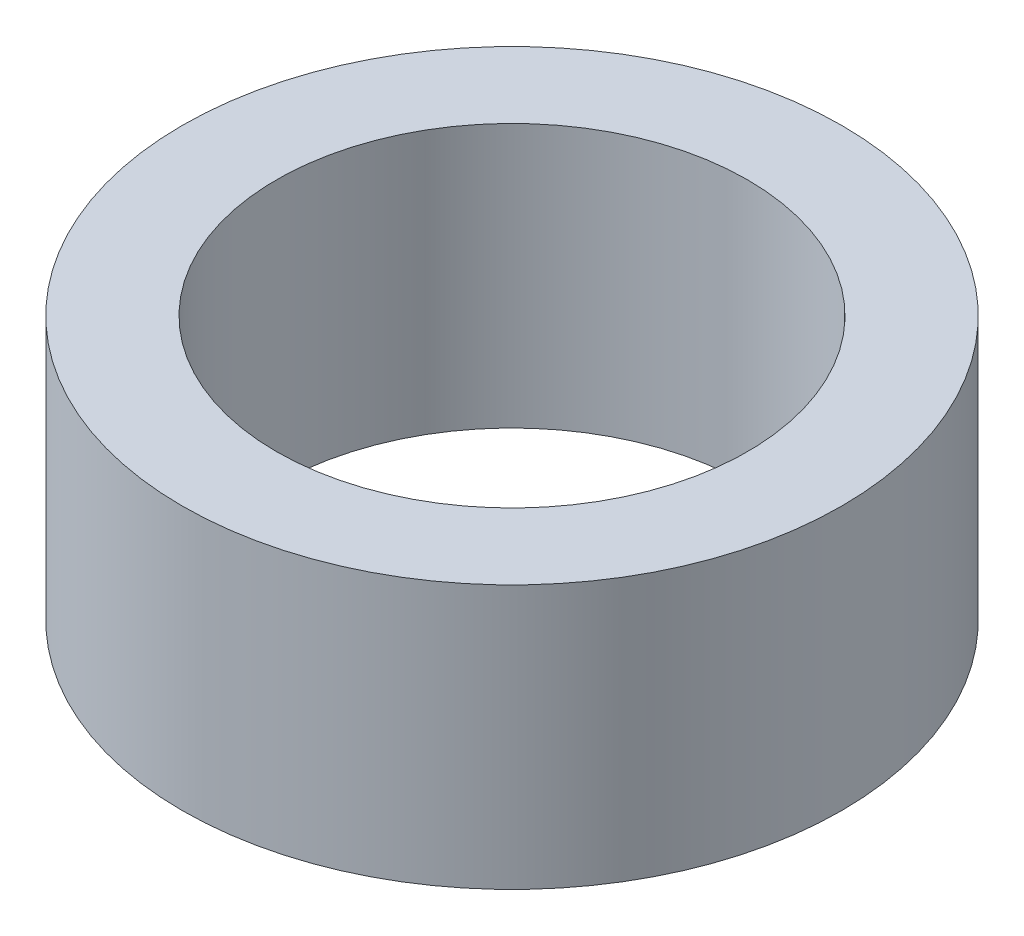
ISO-10303-21;
HEADER;
FILE_DESCRIPTION(('STEP AP214'),'2;1');
FILE_NAME('part.step','',(''),(''),'','','');
FILE_SCHEMA(('AUTOMOTIVE_DESIGN { 1 0 10303 214 1 1 1 1 }'));
ENDSEC;
DATA;
#1=APPLICATION_CONTEXT('core data for automotive mechanical design processes');
#2=APPLICATION_PROTOCOL_DEFINITION('international standard','automotive_design',2000,#1);
#3=PRODUCT_CONTEXT('',#1,'mechanical');
#4=PRODUCT('Part','Part','',(#3));
#5=PRODUCT_RELATED_PRODUCT_CATEGORY('part','',(#4));
#6=PRODUCT_DEFINITION_FORMATION('','',#4);
#7=PRODUCT_DEFINITION_CONTEXT('part definition',#1,'design');
#8=PRODUCT_DEFINITION('design','',#6,#7);
#9=PRODUCT_DEFINITION_SHAPE('','',#8);
#10=(LENGTH_UNIT() NAMED_UNIT(*) SI_UNIT(.MILLI.,.METRE.));
#11=(NAMED_UNIT(*) PLANE_ANGLE_UNIT() SI_UNIT($,.RADIAN.));
#12=(NAMED_UNIT(*) SI_UNIT($,.STERADIAN.) SOLID_ANGLE_UNIT());
#13=UNCERTAINTY_MEASURE_WITH_UNIT(LENGTH_MEASURE(1.E-05),#10,'distance_accuracy_value','');
#14=(GEOMETRIC_REPRESENTATION_CONTEXT(3) GLOBAL_UNCERTAINTY_ASSIGNED_CONTEXT((#13)) GLOBAL_UNIT_ASSIGNED_CONTEXT((#10,
#11,#12)) REPRESENTATION_CONTEXT('',''));
#15=CARTESIAN_POINT('',(0.,0.,0.));
#16=DIRECTION('',(0.,0.,1.));
#17=DIRECTION('',(1.,0.,0.));
#18=AXIS2_PLACEMENT_3D('',#15,#16,#17);
#19=CARTESIAN_POINT('',(0.,28.,0.));
#20=DIRECTION('',(0.,-1.,0.));
#21=DIRECTION('',(0.,0.,-1.));
#22=AXIS2_PLACEMENT_3D('',#19,#20,#21);
#23=CYLINDRICAL_SURFACE('',#22,35.);
#24=CARTESIAN_POINT('',(0.,28.,0.));
#25=DIRECTION('',(0.,1.,0.));
#26=DIRECTION('',(0.,0.,1.));
#27=AXIS2_PLACEMENT_3D('',#24,#25,#26);
#28=CIRCLE('',#27,35.);
#29=CARTESIAN_POINT('',(0.,28.,35.));
#30=VERTEX_POINT('',#29);
#31=EDGE_CURVE('E10',#30,#30,#28,.T.);
#32=ORIENTED_EDGE('',*,*,#31,.F.);
#33=EDGE_LOOP('',(#32));
#34=FACE_BOUND('',#33,.T.);
#35=CARTESIAN_POINT('',(0.,0.,0.));
#36=DIRECTION('',(0.,1.,0.));
#37=DIRECTION('',(0.,0.,1.));
#38=AXIS2_PLACEMENT_3D('',#35,#36,#37);
#39=CIRCLE('',#38,35.);
#40=CARTESIAN_POINT('',(0.,0.,35.));
#41=VERTEX_POINT('',#40);
#42=EDGE_CURVE('E37',#41,#41,#39,.T.);
#43=ORIENTED_EDGE('',*,*,#42,.T.);
#44=EDGE_LOOP('',(#43));
#45=FACE_BOUND('',#44,.T.);
#46=ADVANCED_FACE('F40',(#34,#45),#23,.T.);
#47=CARTESIAN_POINT('',(0.,28.,0.));
#48=DIRECTION('',(0.,1.,0.));
#49=DIRECTION('',(0.,0.,1.));
#50=AXIS2_PLACEMENT_3D('',#47,#48,#49);
#51=PLANE('',#50);
#52=CARTESIAN_POINT('',(0.,28.,0.));
#53=DIRECTION('',(0.,1.,0.));
#54=DIRECTION('',(0.,0.,1.));
#55=AXIS2_PLACEMENT_3D('',#52,#53,#54);
#56=CIRCLE('',#55,25.);
#57=CARTESIAN_POINT('',(0.,28.,25.));
#58=VERTEX_POINT('',#57);
#59=EDGE_CURVE('E50',#58,#58,#56,.T.);
#60=ORIENTED_EDGE('',*,*,#59,.F.);
#61=EDGE_LOOP('',(#60));
#62=FACE_BOUND('',#61,.T.);
#63=ORIENTED_EDGE('',*,*,#31,.T.);
#64=EDGE_LOOP('',(#63));
#65=FACE_BOUND('',#64,.T.);
#66=ADVANCED_FACE('F59',(#62,#65),#51,.T.);
#67=CARTESIAN_POINT('',(0.,0.,0.));
#68=DIRECTION('',(0.,1.,0.));
#69=DIRECTION('',(0.,0.,1.));
#70=AXIS2_PLACEMENT_3D('',#67,#68,#69);
#71=PLANE('',#70);
#72=CARTESIAN_POINT('',(0.,0.,0.));
#73=DIRECTION('',(0.,1.,0.));
#74=DIRECTION('',(0.,0.,1.));
#75=AXIS2_PLACEMENT_3D('',#72,#73,#74);
#76=CIRCLE('',#75,25.);
#77=CARTESIAN_POINT('',(0.,0.,25.));
#78=VERTEX_POINT('',#77);
#79=EDGE_CURVE('E47',#78,#78,#76,.T.);
#80=ORIENTED_EDGE('',*,*,#79,.T.);
#81=EDGE_LOOP('',(#80));
#82=FACE_BOUND('',#81,.T.);
#83=ORIENTED_EDGE('',*,*,#42,.F.);
#84=EDGE_LOOP('',(#83));
#85=FACE_BOUND('',#84,.T.);
#86=ADVANCED_FACE('F58',(#82,#85),#71,.F.);
#87=CARTESIAN_POINT('',(0.,28.,0.));
#88=DIRECTION('',(0.,-1.,0.));
#89=DIRECTION('',(0.,0.,-1.));
#90=AXIS2_PLACEMENT_3D('',#87,#88,#89);
#91=CYLINDRICAL_SURFACE('',#90,25.);
#92=ORIENTED_EDGE('',*,*,#59,.T.);
#93=EDGE_LOOP('',(#92));
#94=FACE_BOUND('',#93,.T.);
#95=ORIENTED_EDGE('',*,*,#79,.F.);
#96=EDGE_LOOP('',(#95));
#97=FACE_BOUND('',#96,.T.);
#98=ADVANCED_FACE('F54',(#94,#97),#91,.F.);
#99=CLOSED_SHELL('',(#46,#66,#86,#98));
#100=MANIFOLD_SOLID_BREP('B2',#99);
#101=ADVANCED_BREP_SHAPE_REPRESENTATION('',(#18,#100),#14);
#102=SHAPE_DEFINITION_REPRESENTATION(#9,#101);
ENDSEC;
END-ISO-10303-21;
